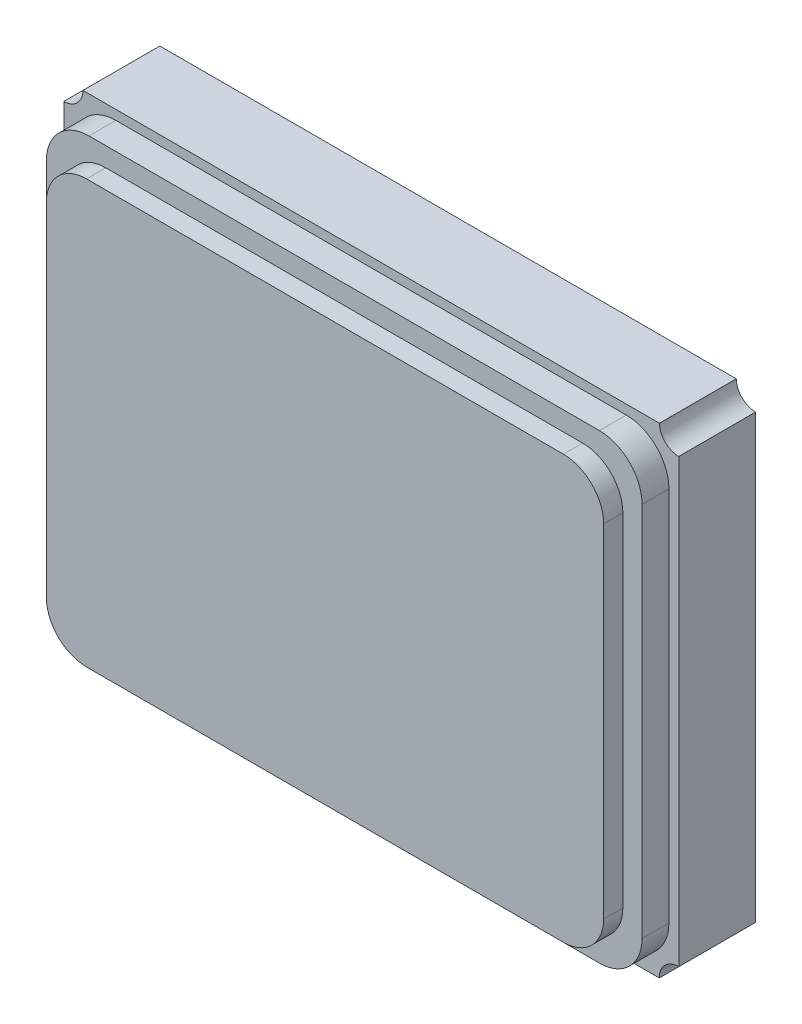
ISO-10303-21;
HEADER;
FILE_DESCRIPTION(('STEP AP214'),'2;1');
FILE_NAME('part.step','',(''),(''),'','','');
FILE_SCHEMA(('AUTOMOTIVE_DESIGN { 1 0 10303 214 1 1 1 1 }'));
ENDSEC;
DATA;
#1=APPLICATION_CONTEXT('core data for automotive mechanical design processes');
#2=APPLICATION_PROTOCOL_DEFINITION('international standard','automotive_design',2000,#1);
#3=PRODUCT_CONTEXT('',#1,'mechanical');
#4=PRODUCT('Part','Part','',(#3));
#5=PRODUCT_RELATED_PRODUCT_CATEGORY('part','',(#4));
#6=PRODUCT_DEFINITION_FORMATION('','',#4);
#7=PRODUCT_DEFINITION_CONTEXT('part definition',#1,'design');
#8=PRODUCT_DEFINITION('design','',#6,#7);
#9=PRODUCT_DEFINITION_SHAPE('','',#8);
#10=(LENGTH_UNIT() NAMED_UNIT(*) SI_UNIT(.MILLI.,.METRE.));
#11=(NAMED_UNIT(*) PLANE_ANGLE_UNIT() SI_UNIT($,.RADIAN.));
#12=(NAMED_UNIT(*) SI_UNIT($,.STERADIAN.) SOLID_ANGLE_UNIT());
#13=UNCERTAINTY_MEASURE_WITH_UNIT(LENGTH_MEASURE(1.E-05),#10,'distance_accuracy_value','');
#14=(GEOMETRIC_REPRESENTATION_CONTEXT(3) GLOBAL_UNCERTAINTY_ASSIGNED_CONTEXT((#13)) GLOBAL_UNIT_ASSIGNED_CONTEXT((#10,
#11,#12)) REPRESENTATION_CONTEXT('',''));
#15=CARTESIAN_POINT('',(0.,0.,0.));
#16=DIRECTION('',(0.,0.,1.));
#17=DIRECTION('',(1.,0.,0.));
#18=AXIS2_PLACEMENT_3D('',#15,#16,#17);
#19=CARTESIAN_POINT('',(0.0008802163144183,-0.0008850774637298,0.));
#20=DIRECTION('',(0.,0.,1.));
#21=DIRECTION('',(1.,0.,0.));
#22=AXIS2_PLACEMENT_3D('',#19,#20,#21);
#23=PLANE('',#22);
#24=DIRECTION('',(1.,0.,0.));
#25=VECTOR('',#24,1.);
#26=CARTESIAN_POINT('',(-1.499580396422,1.249506131818,0.));
#27=LINE('',#26,#25);
#28=CARTESIAN_POINT('',(-1.499580396422,1.249506131818,0.));
#29=VERTEX_POINT('',#28);
#30=CARTESIAN_POINT('',(1.500419603578,1.249506131818,0.));
#31=VERTEX_POINT('',#30);
#32=EDGE_CURVE('E376',#29,#31,#27,.T.);
#33=ORIENTED_EDGE('',*,*,#32,.T.);
#34=CARTESIAN_POINT('',(1.600419603578,1.250214196517,0.));
#35=DIRECTION('',(0.,0.,1.));
#36=DIRECTION('',(1.,0.,0.));
#37=AXIS2_PLACEMENT_3D('',#34,#35,#36);
#38=CIRCLE('',#37,0.100002506747);
#39=CARTESIAN_POINT('',(1.601127668277,1.150214196517,0.));
#40=VERTEX_POINT('',#39);
#41=EDGE_CURVE('E147',#31,#40,#38,.T.);
#42=ORIENTED_EDGE('',*,*,#41,.T.);
#43=DIRECTION('',(0.,-1.,0.));
#44=VECTOR('',#43,1.);
#45=CARTESIAN_POINT('',(1.601127668277,1.150214196517,0.));
#46=LINE('',#45,#44);
#47=CARTESIAN_POINT('',(1.601127668277,-1.149785803483,0.));
#48=VERTEX_POINT('',#47);
#49=EDGE_CURVE('E357',#40,#48,#46,.T.);
#50=ORIENTED_EDGE('',*,*,#49,.T.);
#51=CARTESIAN_POINT('',(1.599580396422,-1.249785803483,0.));
#52=DIRECTION('',(0.,0.,1.));
#53=DIRECTION('',(1.,0.,0.));
#54=AXIS2_PLACEMENT_3D('',#51,#52,#53);
#55=CIRCLE('',#54,0.100011969535);
#56=CARTESIAN_POINT('',(1.499580396422,-1.251333075338,0.));
#57=VERTEX_POINT('',#56);
#58=EDGE_CURVE('E28',#48,#57,#55,.T.);
#59=ORIENTED_EDGE('',*,*,#58,.T.);
#60=DIRECTION('',(-1.,0.,0.));
#61=VECTOR('',#60,1.);
#62=CARTESIAN_POINT('',(1.499580396422,-1.251333075338,0.));
#63=LINE('',#62,#61);
#64=CARTESIAN_POINT('',(-1.500419603578,-1.251333075338,0.));
#65=VERTEX_POINT('',#64);
#66=EDGE_CURVE('E11',#57,#65,#63,.T.);
#67=ORIENTED_EDGE('',*,*,#66,.T.);
#68=CARTESIAN_POINT('',(-1.600419603578,-1.250214196517,0.));
#69=DIRECTION('',(0.,0.,1.));
#70=DIRECTION('',(1.,0.,0.));
#71=AXIS2_PLACEMENT_3D('',#68,#69,#70);
#72=CIRCLE('',#71,0.100006259253);
#73=CARTESIAN_POINT('',(-1.599300724757,-1.150214196517,0.));
#74=VERTEX_POINT('',#73);
#75=EDGE_CURVE('E324',#65,#74,#72,.T.);
#76=ORIENTED_EDGE('',*,*,#75,.T.);
#77=DIRECTION('',(0.,1.,0.));
#78=VECTOR('',#77,1.);
#79=CARTESIAN_POINT('',(-1.599300724757,-1.150214196517,0.));
#80=LINE('',#79,#78);
#81=CARTESIAN_POINT('',(-1.599300724757,1.149785803483,0.));
#82=VERTEX_POINT('',#81);
#83=EDGE_CURVE('E349',#74,#82,#80,.T.);
#84=ORIENTED_EDGE('',*,*,#83,.T.);
#85=CARTESIAN_POINT('',(-1.599580396422,1.249785803483,0.));
#86=DIRECTION('',(0.,0.,1.));
#87=DIRECTION('',(1.,0.,0.));
#88=AXIS2_PLACEMENT_3D('',#85,#86,#87);
#89=CIRCLE('',#88,0.10000039108);
#90=EDGE_CURVE('E158',#82,#29,#89,.T.);
#91=ORIENTED_EDGE('',*,*,#90,.T.);
#92=EDGE_LOOP('',(#33,#42,#50,#59,#67,#76,#84,#91));
#93=FACE_BOUND('',#92,.T.);
#94=ADVANCED_FACE('F17',(#93),#23,.F.);
#95=CARTESIAN_POINT('',(1.499580396422,-1.251333075338,0.));
#96=DIRECTION('',(0.,-1.,0.));
#97=DIRECTION('',(0.,0.,-1.));
#98=AXIS2_PLACEMENT_3D('',#95,#96,#97);
#99=PLANE('',#98);
#100=DIRECTION('',(0.,0.,1.));
#101=VECTOR('',#100,1.);
#102=CARTESIAN_POINT('',(1.499580396422,-1.251333075338,0.));
#103=LINE('',#102,#101);
#104=CARTESIAN_POINT('',(1.499580396422,-1.251333075338,0.4));
#105=VERTEX_POINT('',#104);
#106=EDGE_CURVE('E174',#57,#105,#103,.T.);
#107=ORIENTED_EDGE('',*,*,#106,.T.);
#108=DIRECTION('',(-1.,0.,0.));
#109=VECTOR('',#108,1.);
#110=CARTESIAN_POINT('',(1.499580396422,-1.251333075338,0.4));
#111=LINE('',#110,#109);
#112=CARTESIAN_POINT('',(-1.500419603578,-1.251333075338,0.4));
#113=VERTEX_POINT('',#112);
#114=EDGE_CURVE('E304',#105,#113,#111,.T.);
#115=ORIENTED_EDGE('',*,*,#114,.T.);
#116=DIRECTION('',(0.,0.,1.));
#117=VECTOR('',#116,1.);
#118=CARTESIAN_POINT('',(-1.500419603578,-1.251333075338,0.));
#119=LINE('',#118,#117);
#120=EDGE_CURVE('E21',#65,#113,#119,.T.);
#121=ORIENTED_EDGE('',*,*,#120,.F.);
#122=ORIENTED_EDGE('',*,*,#66,.F.);
#123=EDGE_LOOP('',(#107,#115,#121,#122));
#124=FACE_BOUND('',#123,.T.);
#125=ADVANCED_FACE('F600',(#124),#99,.T.);
#126=CARTESIAN_POINT('',(1.599580396422,-1.249785803483,0.));
#127=DIRECTION('',(0.,0.,-1.));
#128=DIRECTION('',(1.,0.,0.));
#129=AXIS2_PLACEMENT_3D('',#126,#127,#128);
#130=CYLINDRICAL_SURFACE('',#129,0.100011969535);
#131=DIRECTION('',(0.,0.,1.));
#132=VECTOR('',#131,1.);
#133=CARTESIAN_POINT('',(1.601127668277,-1.149785803483,0.));
#134=LINE('',#133,#132);
#135=CARTESIAN_POINT('',(1.601127668277,-1.149785803483,0.4));
#136=VERTEX_POINT('',#135);
#137=EDGE_CURVE('E354',#48,#136,#134,.T.);
#138=ORIENTED_EDGE('',*,*,#137,.T.);
#139=CARTESIAN_POINT('',(1.599580396422,-1.249785803483,0.4));
#140=DIRECTION('',(0.,0.,1.));
#141=DIRECTION('',(1.,0.,0.));
#142=AXIS2_PLACEMENT_3D('',#139,#140,#141);
#143=CIRCLE('',#142,0.100011969535);
#144=EDGE_CURVE('E307',#136,#105,#143,.T.);
#145=ORIENTED_EDGE('',*,*,#144,.T.);
#146=ORIENTED_EDGE('',*,*,#106,.F.);
#147=ORIENTED_EDGE('',*,*,#58,.F.);
#148=EDGE_LOOP('',(#138,#145,#146,#147));
#149=FACE_BOUND('',#148,.T.);
#150=ADVANCED_FACE('F605',(#149),#130,.F.);
#151=CARTESIAN_POINT('',(-1.600419603578,-1.250214196517,0.));
#152=DIRECTION('',(0.,0.,-1.));
#153=DIRECTION('',(1.,0.,0.));
#154=AXIS2_PLACEMENT_3D('',#151,#152,#153);
#155=CYLINDRICAL_SURFACE('',#154,0.100006259253);
#156=ORIENTED_EDGE('',*,*,#120,.T.);
#157=CARTESIAN_POINT('',(-1.600419603578,-1.250214196517,0.4));
#158=DIRECTION('',(0.,0.,1.));
#159=DIRECTION('',(1.,0.,0.));
#160=AXIS2_PLACEMENT_3D('',#157,#158,#159);
#161=CIRCLE('',#160,0.100006259253);
#162=CARTESIAN_POINT('',(-1.599300724757,-1.150214196517,0.4));
#163=VERTEX_POINT('',#162);
#164=EDGE_CURVE('E308',#113,#163,#161,.T.);
#165=ORIENTED_EDGE('',*,*,#164,.T.);
#166=DIRECTION('',(0.,0.,1.));
#167=VECTOR('',#166,1.);
#168=CARTESIAN_POINT('',(-1.599300724757,-1.150214196517,0.));
#169=LINE('',#168,#167);
#170=EDGE_CURVE('E346',#74,#163,#169,.T.);
#171=ORIENTED_EDGE('',*,*,#170,.F.);
#172=ORIENTED_EDGE('',*,*,#75,.F.);
#173=EDGE_LOOP('',(#156,#165,#171,#172));
#174=FACE_BOUND('',#173,.T.);
#175=ADVANCED_FACE('F630',(#174),#155,.F.);
#176=CARTESIAN_POINT('',(1.601127668277,1.150214196517,0.));
#177=DIRECTION('',(1.,0.,0.));
#178=DIRECTION('',(0.,1.,0.));
#179=AXIS2_PLACEMENT_3D('',#176,#177,#178);
#180=PLANE('',#179);
#181=DIRECTION('',(0.,0.,1.));
#182=VECTOR('',#181,1.);
#183=CARTESIAN_POINT('',(1.601127668277,1.150214196517,0.));
#184=LINE('',#183,#182);
#185=CARTESIAN_POINT('',(1.601127668277,1.150214196517,0.4));
#186=VERTEX_POINT('',#185);
#187=EDGE_CURVE('E319',#40,#186,#184,.T.);
#188=ORIENTED_EDGE('',*,*,#187,.T.);
#189=DIRECTION('',(0.,-1.,0.));
#190=VECTOR('',#189,1.);
#191=CARTESIAN_POINT('',(1.601127668277,1.150214196517,0.4));
#192=LINE('',#191,#190);
#193=EDGE_CURVE('E314',#186,#136,#192,.T.);
#194=ORIENTED_EDGE('',*,*,#193,.T.);
#195=ORIENTED_EDGE('',*,*,#137,.F.);
#196=ORIENTED_EDGE('',*,*,#49,.F.);
#197=EDGE_LOOP('',(#188,#194,#195,#196));
#198=FACE_BOUND('',#197,.T.);
#199=ADVANCED_FACE('F609',(#198),#180,.T.);
#200=CARTESIAN_POINT('',(-1.599300724757,-1.150214196517,0.));
#201=DIRECTION('',(-1.,0.,0.));
#202=DIRECTION('',(0.,0.,1.));
#203=AXIS2_PLACEMENT_3D('',#200,#201,#202);
#204=PLANE('',#203);
#205=ORIENTED_EDGE('',*,*,#170,.T.);
#206=DIRECTION('',(0.,1.,0.));
#207=VECTOR('',#206,1.);
#208=CARTESIAN_POINT('',(-1.599300724757,-1.150214196517,0.4));
#209=LINE('',#208,#207);
#210=CARTESIAN_POINT('',(-1.599300724757,1.149785803483,0.4));
#211=VERTEX_POINT('',#210);
#212=EDGE_CURVE('E362',#163,#211,#209,.T.);
#213=ORIENTED_EDGE('',*,*,#212,.T.);
#214=DIRECTION('',(0.,0.,1.));
#215=VECTOR('',#214,1.);
#216=CARTESIAN_POINT('',(-1.599300724757,1.149785803483,0.));
#217=LINE('',#216,#215);
#218=EDGE_CURVE('E379',#82,#211,#217,.T.);
#219=ORIENTED_EDGE('',*,*,#218,.F.);
#220=ORIENTED_EDGE('',*,*,#83,.F.);
#221=EDGE_LOOP('',(#205,#213,#219,#220));
#222=FACE_BOUND('',#221,.T.);
#223=ADVANCED_FACE('F645',(#222),#204,.T.);
#224=CARTESIAN_POINT('',(1.600419603578,1.250214196517,0.));
#225=DIRECTION('',(0.,0.,-1.));
#226=DIRECTION('',(1.,0.,0.));
#227=AXIS2_PLACEMENT_3D('',#224,#225,#226);
#228=CYLINDRICAL_SURFACE('',#227,0.100002506747);
#229=DIRECTION('',(0.,0.,1.));
#230=VECTOR('',#229,1.);
#231=CARTESIAN_POINT('',(1.500419603578,1.249506131818,0.));
#232=LINE('',#231,#230);
#233=CARTESIAN_POINT('',(1.500419603578,1.249506131818,0.4));
#234=VERTEX_POINT('',#233);
#235=EDGE_CURVE('E380',#31,#234,#232,.T.);
#236=ORIENTED_EDGE('',*,*,#235,.T.);
#237=CARTESIAN_POINT('',(1.600419603578,1.250214196517,0.4));
#238=DIRECTION('',(0.,0.,1.));
#239=DIRECTION('',(1.,0.,0.));
#240=AXIS2_PLACEMENT_3D('',#237,#238,#239);
#241=CIRCLE('',#240,0.100002506747);
#242=EDGE_CURVE('E318',#234,#186,#241,.T.);
#243=ORIENTED_EDGE('',*,*,#242,.T.);
#244=ORIENTED_EDGE('',*,*,#187,.F.);
#245=ORIENTED_EDGE('',*,*,#41,.F.);
#246=EDGE_LOOP('',(#236,#243,#244,#245));
#247=FACE_BOUND('',#246,.T.);
#248=ADVANCED_FACE('F466',(#247),#228,.F.);
#249=CARTESIAN_POINT('',(-1.599580396422,1.249785803483,0.));
#250=DIRECTION('',(0.,0.,-1.));
#251=DIRECTION('',(1.,0.,0.));
#252=AXIS2_PLACEMENT_3D('',#249,#250,#251);
#253=CYLINDRICAL_SURFACE('',#252,0.10000039108);
#254=ORIENTED_EDGE('',*,*,#218,.T.);
#255=CARTESIAN_POINT('',(-1.599580396422,1.249785803483,0.4));
#256=DIRECTION('',(0.,0.,1.));
#257=DIRECTION('',(1.,0.,0.));
#258=AXIS2_PLACEMENT_3D('',#255,#256,#257);
#259=CIRCLE('',#258,0.10000039108);
#260=CARTESIAN_POINT('',(-1.499580396422,1.249506131818,0.4));
#261=VERTEX_POINT('',#260);
#262=EDGE_CURVE('E358',#211,#261,#259,.T.);
#263=ORIENTED_EDGE('',*,*,#262,.T.);
#264=DIRECTION('',(0.,0.,1.));
#265=VECTOR('',#264,1.);
#266=CARTESIAN_POINT('',(-1.499580396422,1.249506131818,0.));
#267=LINE('',#266,#265);
#268=EDGE_CURVE('E395',#29,#261,#267,.T.);
#269=ORIENTED_EDGE('',*,*,#268,.F.);
#270=ORIENTED_EDGE('',*,*,#90,.F.);
#271=EDGE_LOOP('',(#254,#263,#269,#270));
#272=FACE_BOUND('',#271,.T.);
#273=ADVANCED_FACE('F477',(#272),#253,.F.);
#274=CARTESIAN_POINT('',(-1.499580396422,1.249506131818,0.));
#275=DIRECTION('',(0.,1.,0.));
#276=DIRECTION('',(1.,0.,0.));
#277=AXIS2_PLACEMENT_3D('',#274,#275,#276);
#278=PLANE('',#277);
#279=ORIENTED_EDGE('',*,*,#268,.T.);
#280=DIRECTION('',(1.,0.,0.));
#281=VECTOR('',#280,1.);
#282=CARTESIAN_POINT('',(-1.499580396422,1.249506131818,0.4));
#283=LINE('',#282,#281);
#284=EDGE_CURVE('E363',#261,#234,#283,.T.);
#285=ORIENTED_EDGE('',*,*,#284,.T.);
#286=ORIENTED_EDGE('',*,*,#235,.F.);
#287=ORIENTED_EDGE('',*,*,#32,.F.);
#288=EDGE_LOOP('',(#279,#285,#286,#287));
#289=FACE_BOUND('',#288,.T.);
#290=ADVANCED_FACE('F474',(#289),#278,.T.);
#291=CARTESIAN_POINT('',(0.0008802163144183,-0.0008850774637298,0.4));
#292=DIRECTION('',(0.,0.,1.));
#293=DIRECTION('',(1.,0.,0.));
#294=AXIS2_PLACEMENT_3D('',#291,#292,#293);
#295=PLANE('',#294);
#296=CARTESIAN_POINT('',(1.328205850256,-0.978205850256,0.4));
#297=DIRECTION('',(0.,0.,-1.));
#298=DIRECTION('',(1.,0.,0.));
#299=AXIS2_PLACEMENT_3D('',#296,#297,#298);
#300=CIRCLE('',#299,0.221794149744);
#301=CARTESIAN_POINT('',(1.55,-0.978205850256,0.4));
#302=VERTEX_POINT('',#301);
#303=CARTESIAN_POINT('',(1.328205850256,-1.2,0.4));
#304=VERTEX_POINT('',#303);
#305=EDGE_CURVE('E266',#302,#304,#300,.T.);
#306=ORIENTED_EDGE('',*,*,#305,.T.);
#307=DIRECTION('',(-1.,0.,0.));
#308=VECTOR('',#307,1.);
#309=CARTESIAN_POINT('',(-0.663662816971,-1.2,0.4));
#310=LINE('',#309,#308);
#311=CARTESIAN_POINT('',(-1.328205850256,-1.2,0.4));
#312=VERTEX_POINT('',#311);
#313=EDGE_CURVE('E429',#304,#312,#310,.T.);
#314=ORIENTED_EDGE('',*,*,#313,.T.);
#315=CARTESIAN_POINT('',(-1.328205850256,-0.978205850256,0.4));
#316=DIRECTION('',(0.,0.,-1.));
#317=DIRECTION('',(1.,0.,0.));
#318=AXIS2_PLACEMENT_3D('',#315,#316,#317);
#319=CIRCLE('',#318,0.221794149744);
#320=CARTESIAN_POINT('',(-1.55,-0.978205850256,0.4));
#321=VERTEX_POINT('',#320);
#322=EDGE_CURVE('E303',#312,#321,#319,.T.);
#323=ORIENTED_EDGE('',*,*,#322,.T.);
#324=DIRECTION('',(0.,1.,0.));
#325=VECTOR('',#324,1.);
#326=CARTESIAN_POINT('',(-1.55,0.488660386396,0.4));
#327=LINE('',#326,#325);
#328=CARTESIAN_POINT('',(-1.55,0.978205850256,0.4));
#329=VERTEX_POINT('',#328);
#330=EDGE_CURVE('E265',#321,#329,#327,.T.);
#331=ORIENTED_EDGE('',*,*,#330,.T.);
#332=CARTESIAN_POINT('',(-1.328205850256,0.978205850256,0.4));
#333=DIRECTION('',(0.,0.,-1.));
#334=DIRECTION('',(1.,0.,0.));
#335=AXIS2_PLACEMENT_3D('',#332,#333,#334);
#336=CIRCLE('',#335,0.221794149744);
#337=CARTESIAN_POINT('',(-1.328205850256,1.2,0.4));
#338=VERTEX_POINT('',#337);
#339=EDGE_CURVE('E261',#329,#338,#336,.T.);
#340=ORIENTED_EDGE('',*,*,#339,.T.);
#341=DIRECTION('',(1.,0.,0.));
#342=VECTOR('',#341,1.);
#343=CARTESIAN_POINT('',(0.664543033285,1.2,0.4));
#344=LINE('',#343,#342);
#345=CARTESIAN_POINT('',(1.328205850256,1.2,0.4));
#346=VERTEX_POINT('',#345);
#347=EDGE_CURVE('E401',#338,#346,#344,.T.);
#348=ORIENTED_EDGE('',*,*,#347,.T.);
#349=CARTESIAN_POINT('',(1.328205850256,0.978205850256,0.4));
#350=DIRECTION('',(0.,0.,-1.));
#351=DIRECTION('',(1.,0.,0.));
#352=AXIS2_PLACEMENT_3D('',#349,#350,#351);
#353=CIRCLE('',#352,0.221794149744);
#354=CARTESIAN_POINT('',(1.55,0.978205850256,0.4));
#355=VERTEX_POINT('',#354);
#356=EDGE_CURVE('E397',#346,#355,#353,.T.);
#357=ORIENTED_EDGE('',*,*,#356,.T.);
#358=DIRECTION('',(0.,-1.,0.));
#359=VECTOR('',#358,1.);
#360=CARTESIAN_POINT('',(1.55,-0.48954546386,0.4));
#361=LINE('',#360,#359);
#362=EDGE_CURVE('E342',#355,#302,#361,.T.);
#363=ORIENTED_EDGE('',*,*,#362,.T.);
#364=EDGE_LOOP('',(#306,#314,#323,#331,#340,#348,#357,#363));
#365=FACE_BOUND('',#364,.T.);
#366=ORIENTED_EDGE('',*,*,#284,.F.);
#367=ORIENTED_EDGE('',*,*,#262,.F.);
#368=ORIENTED_EDGE('',*,*,#212,.F.);
#369=ORIENTED_EDGE('',*,*,#164,.F.);
#370=ORIENTED_EDGE('',*,*,#114,.F.);
#371=ORIENTED_EDGE('',*,*,#144,.F.);
#372=ORIENTED_EDGE('',*,*,#193,.F.);
#373=ORIENTED_EDGE('',*,*,#242,.F.);
#374=EDGE_LOOP('',(#366,#367,#368,#369,#370,#371,#372,#373));
#375=FACE_BOUND('',#374,.T.);
#376=ADVANCED_FACE('F471',(#365,#375),#295,.T.);
#377=CARTESIAN_POINT('',(1.328205850256,1.2,0.39));
#378=DIRECTION('',(0.,-1.,0.));
#379=DIRECTION('',(0.,0.,-1.));
#380=AXIS2_PLACEMENT_3D('',#377,#378,#379);
#381=PLANE('',#380);
#382=DIRECTION('',(0.,0.,1.));
#383=VECTOR('',#382,1.);
#384=CARTESIAN_POINT('',(-1.328205850256,1.2,0.39));
#385=LINE('',#384,#383);
#386=CARTESIAN_POINT('',(-1.328205850256,1.2,0.54));
#387=VERTEX_POINT('',#386);
#388=EDGE_CURVE('E345',#338,#387,#385,.T.);
#389=ORIENTED_EDGE('',*,*,#388,.T.);
#390=DIRECTION('',(-1.,0.,0.));
#391=VECTOR('',#390,1.);
#392=CARTESIAN_POINT('',(1.328205850256,1.2,0.54));
#393=LINE('',#392,#391);
#394=CARTESIAN_POINT('',(1.328205850256,1.2,0.54));
#395=VERTEX_POINT('',#394);
#396=EDGE_CURVE('E283',#395,#387,#393,.T.);
#397=ORIENTED_EDGE('',*,*,#396,.F.);
#398=DIRECTION('',(0.,0.,1.));
#399=VECTOR('',#398,1.);
#400=CARTESIAN_POINT('',(1.328205850256,1.2,0.39));
#401=LINE('',#400,#399);
#402=EDGE_CURVE('E402',#346,#395,#401,.T.);
#403=ORIENTED_EDGE('',*,*,#402,.F.);
#404=ORIENTED_EDGE('',*,*,#347,.F.);
#405=EDGE_LOOP('',(#389,#397,#403,#404));
#406=FACE_BOUND('',#405,.T.);
#407=ADVANCED_FACE('F531',(#406),#381,.F.);
#408=CARTESIAN_POINT('',(1.328205850256,0.978205850256,0.39));
#409=DIRECTION('',(0.,0.,-1.));
#410=DIRECTION('',(1.,0.,0.));
#411=AXIS2_PLACEMENT_3D('',#408,#409,#410);
#412=CYLINDRICAL_SURFACE('',#411,0.221794149744);
#413=ORIENTED_EDGE('',*,*,#402,.T.);
#414=CARTESIAN_POINT('',(1.328205850256,0.978205850256,0.54));
#415=DIRECTION('',(0.,0.,1.));
#416=DIRECTION('',(1.,0.,0.));
#417=AXIS2_PLACEMENT_3D('',#414,#415,#416);
#418=CIRCLE('',#417,0.221794149744);
#419=CARTESIAN_POINT('',(1.55,0.978205850256,0.54));
#420=VERTEX_POINT('',#419);
#421=EDGE_CURVE('E289',#420,#395,#418,.T.);
#422=ORIENTED_EDGE('',*,*,#421,.F.);
#423=DIRECTION('',(0.,0.,1.));
#424=VECTOR('',#423,1.);
#425=CARTESIAN_POINT('',(1.55,0.978205850256,0.39));
#426=LINE('',#425,#424);
#427=EDGE_CURVE('E327',#355,#420,#426,.T.);
#428=ORIENTED_EDGE('',*,*,#427,.F.);
#429=ORIENTED_EDGE('',*,*,#356,.F.);
#430=EDGE_LOOP('',(#413,#422,#428,#429));
#431=FACE_BOUND('',#430,.T.);
#432=ADVANCED_FACE('F528',(#431),#412,.T.);
#433=CARTESIAN_POINT('',(-1.328205850256,0.978205850256,0.39));
#434=DIRECTION('',(0.,0.,-1.));
#435=DIRECTION('',(1.,0.,0.));
#436=AXIS2_PLACEMENT_3D('',#433,#434,#435);
#437=CYLINDRICAL_SURFACE('',#436,0.221794149744);
#438=DIRECTION('',(0.,0.,1.));
#439=VECTOR('',#438,1.);
#440=CARTESIAN_POINT('',(-1.55,0.978205850256,0.39));
#441=LINE('',#440,#439);
#442=CARTESIAN_POINT('',(-1.55,0.978205850256,0.54));
#443=VERTEX_POINT('',#442);
#444=EDGE_CURVE('E253',#329,#443,#441,.T.);
#445=ORIENTED_EDGE('',*,*,#444,.T.);
#446=CARTESIAN_POINT('',(-1.328205850256,0.978205850256,0.54));
#447=DIRECTION('',(0.,0.,1.));
#448=DIRECTION('',(1.,0.,0.));
#449=AXIS2_PLACEMENT_3D('',#446,#447,#448);
#450=CIRCLE('',#449,0.221794149744);
#451=EDGE_CURVE('E258',#387,#443,#450,.T.);
#452=ORIENTED_EDGE('',*,*,#451,.F.);
#453=ORIENTED_EDGE('',*,*,#388,.F.);
#454=ORIENTED_EDGE('',*,*,#339,.F.);
#455=EDGE_LOOP('',(#445,#452,#453,#454));
#456=FACE_BOUND('',#455,.T.);
#457=ADVANCED_FACE('F255',(#456),#437,.T.);
#458=CARTESIAN_POINT('',(1.55,-0.978205850256,0.39));
#459=DIRECTION('',(-1.,0.,0.));
#460=DIRECTION('',(0.,0.,1.));
#461=AXIS2_PLACEMENT_3D('',#458,#459,#460);
#462=PLANE('',#461);
#463=ORIENTED_EDGE('',*,*,#427,.T.);
#464=DIRECTION('',(0.,1.,0.));
#465=VECTOR('',#464,1.);
#466=CARTESIAN_POINT('',(1.55,-0.978205850256,0.54));
#467=LINE('',#466,#465);
#468=CARTESIAN_POINT('',(1.55,-0.978205850256,0.54));
#469=VERTEX_POINT('',#468);
#470=EDGE_CURVE('E292',#469,#420,#467,.T.);
#471=ORIENTED_EDGE('',*,*,#470,.F.);
#472=DIRECTION('',(0.,0.,1.));
#473=VECTOR('',#472,1.);
#474=CARTESIAN_POINT('',(1.55,-0.978205850256,0.39));
#475=LINE('',#474,#473);
#476=EDGE_CURVE('E207',#302,#469,#475,.T.);
#477=ORIENTED_EDGE('',*,*,#476,.F.);
#478=ORIENTED_EDGE('',*,*,#362,.F.);
#479=EDGE_LOOP('',(#463,#471,#477,#478));
#480=FACE_BOUND('',#479,.T.);
#481=ADVANCED_FACE('F523',(#480),#462,.F.);
#482=CARTESIAN_POINT('',(-1.55,0.978205850256,0.39));
#483=DIRECTION('',(1.,0.,0.));
#484=DIRECTION('',(0.,1.,0.));
#485=AXIS2_PLACEMENT_3D('',#482,#483,#484);
#486=PLANE('',#485);
#487=DIRECTION('',(0.,0.,1.));
#488=VECTOR('',#487,1.);
#489=CARTESIAN_POINT('',(-1.55,-0.978205850256,0.39));
#490=LINE('',#489,#488);
#491=CARTESIAN_POINT('',(-1.55,-0.978205850256,0.54));
#492=VERTEX_POINT('',#491);
#493=EDGE_CURVE('E272',#321,#492,#490,.T.);
#494=ORIENTED_EDGE('',*,*,#493,.T.);
#495=DIRECTION('',(0.,-1.,0.));
#496=VECTOR('',#495,1.);
#497=CARTESIAN_POINT('',(-1.55,0.978205850256,0.54));
#498=LINE('',#497,#496);
#499=EDGE_CURVE('E269',#443,#492,#498,.T.);
#500=ORIENTED_EDGE('',*,*,#499,.F.);
#501=ORIENTED_EDGE('',*,*,#444,.F.);
#502=ORIENTED_EDGE('',*,*,#330,.F.);
#503=EDGE_LOOP('',(#494,#500,#501,#502));
#504=FACE_BOUND('',#503,.T.);
#505=ADVANCED_FACE('F270',(#504),#486,.F.);
#506=CARTESIAN_POINT('',(1.328205850256,-0.978205850256,0.39));
#507=DIRECTION('',(0.,0.,-1.));
#508=DIRECTION('',(1.,0.,0.));
#509=AXIS2_PLACEMENT_3D('',#506,#507,#508);
#510=CYLINDRICAL_SURFACE('',#509,0.221794149744);
#511=ORIENTED_EDGE('',*,*,#476,.T.);
#512=CARTESIAN_POINT('',(1.328205850256,-0.978205850256,0.54));
#513=DIRECTION('',(0.,0.,1.));
#514=DIRECTION('',(1.,0.,0.));
#515=AXIS2_PLACEMENT_3D('',#512,#513,#514);
#516=CIRCLE('',#515,0.221794149744);
#517=CARTESIAN_POINT('',(1.328205850256,-1.2,0.54));
#518=VERTEX_POINT('',#517);
#519=EDGE_CURVE('E495',#518,#469,#516,.T.);
#520=ORIENTED_EDGE('',*,*,#519,.F.);
#521=DIRECTION('',(0.,0.,1.));
#522=VECTOR('',#521,1.);
#523=CARTESIAN_POINT('',(1.328205850256,-1.2,0.39));
#524=LINE('',#523,#522);
#525=EDGE_CURVE('E219',#304,#518,#524,.T.);
#526=ORIENTED_EDGE('',*,*,#525,.F.);
#527=ORIENTED_EDGE('',*,*,#305,.F.);
#528=EDGE_LOOP('',(#511,#520,#526,#527));
#529=FACE_BOUND('',#528,.T.);
#530=ADVANCED_FACE('F615',(#529),#510,.T.);
#531=CARTESIAN_POINT('',(-1.328205850256,-0.978205850256,0.39));
#532=DIRECTION('',(0.,0.,-1.));
#533=DIRECTION('',(1.,0.,0.));
#534=AXIS2_PLACEMENT_3D('',#531,#532,#533);
#535=CYLINDRICAL_SURFACE('',#534,0.221794149744);
#536=DIRECTION('',(0.,0.,1.));
#537=VECTOR('',#536,1.);
#538=CARTESIAN_POINT('',(-1.328205850256,-1.2,0.39));
#539=LINE('',#538,#537);
#540=CARTESIAN_POINT('',(-1.328205850256,-1.2,0.54));
#541=VERTEX_POINT('',#540);
#542=EDGE_CURVE('E433',#312,#541,#539,.T.);
#543=ORIENTED_EDGE('',*,*,#542,.T.);
#544=CARTESIAN_POINT('',(-1.328205850256,-0.978205850256,0.54));
#545=DIRECTION('',(0.,0.,1.));
#546=DIRECTION('',(1.,0.,0.));
#547=AXIS2_PLACEMENT_3D('',#544,#545,#546);
#548=CIRCLE('',#547,0.221794149744);
#549=EDGE_CURVE('E277',#492,#541,#548,.T.);
#550=ORIENTED_EDGE('',*,*,#549,.F.);
#551=ORIENTED_EDGE('',*,*,#493,.F.);
#552=ORIENTED_EDGE('',*,*,#322,.F.);
#553=EDGE_LOOP('',(#543,#550,#551,#552));
#554=FACE_BOUND('',#553,.T.);
#555=ADVANCED_FACE('F618',(#554),#535,.T.);
#556=CARTESIAN_POINT('',(-1.328205850256,-1.2,0.39));
#557=DIRECTION('',(0.,1.,0.));
#558=DIRECTION('',(1.,0.,0.));
#559=AXIS2_PLACEMENT_3D('',#556,#557,#558);
#560=PLANE('',#559);
#561=ORIENTED_EDGE('',*,*,#525,.T.);
#562=DIRECTION('',(1.,0.,0.));
#563=VECTOR('',#562,1.);
#564=CARTESIAN_POINT('',(-1.328205850256,-1.2,0.54));
#565=LINE('',#564,#563);
#566=EDGE_CURVE('E369',#541,#518,#565,.T.);
#567=ORIENTED_EDGE('',*,*,#566,.F.);
#568=ORIENTED_EDGE('',*,*,#542,.F.);
#569=ORIENTED_EDGE('',*,*,#313,.F.);
#570=EDGE_LOOP('',(#561,#567,#568,#569));
#571=FACE_BOUND('',#570,.T.);
#572=ADVANCED_FACE('F595',(#571),#560,.F.);
#573=CARTESIAN_POINT('',(0.,0.,0.54));
#574=DIRECTION('',(0.,0.,1.));
#575=DIRECTION('',(1.,0.,0.));
#576=AXIS2_PLACEMENT_3D('',#573,#574,#575);
#577=PLANE('',#576);
#578=DIRECTION('',(1.,0.,0.));
#579=VECTOR('',#578,1.);
#580=CARTESIAN_POINT('',(-1.240692780974,-1.1,0.54));
#581=LINE('',#580,#579);
#582=CARTESIAN_POINT('',(-1.240692780974,-1.1,0.54));
#583=VERTEX_POINT('',#582);
#584=CARTESIAN_POINT('',(1.240692780974,-1.1,0.54));
#585=VERTEX_POINT('',#584);
#586=EDGE_CURVE('E387',#583,#585,#581,.T.);
#587=ORIENTED_EDGE('',*,*,#586,.F.);
#588=CARTESIAN_POINT('',(-1.240692780974,-0.890692780974,0.54));
#589=DIRECTION('',(0.,0.,1.));
#590=DIRECTION('',(1.,0.,0.));
#591=AXIS2_PLACEMENT_3D('',#588,#589,#590);
#592=CIRCLE('',#591,0.209307219026);
#593=CARTESIAN_POINT('',(-1.45,-0.890692780974,0.54));
#594=VERTEX_POINT('',#593);
#595=EDGE_CURVE('E366',#594,#583,#592,.T.);
#596=ORIENTED_EDGE('',*,*,#595,.F.);
#597=DIRECTION('',(0.,-1.,0.));
#598=VECTOR('',#597,1.);
#599=CARTESIAN_POINT('',(-1.45,0.890692780974,0.54));
#600=LINE('',#599,#598);
#601=CARTESIAN_POINT('',(-1.45,0.890692780974,0.54));
#602=VERTEX_POINT('',#601);
#603=EDGE_CURVE('E411',#602,#594,#600,.T.);
#604=ORIENTED_EDGE('',*,*,#603,.F.);
#605=CARTESIAN_POINT('',(-1.240692780974,0.890692780974,0.54));
#606=DIRECTION('',(0.,0.,1.));
#607=DIRECTION('',(1.,0.,0.));
#608=AXIS2_PLACEMENT_3D('',#605,#606,#607);
#609=CIRCLE('',#608,0.209307219026);
#610=CARTESIAN_POINT('',(-1.240692780974,1.1,0.54));
#611=VERTEX_POINT('',#610);
#612=EDGE_CURVE('E312',#611,#602,#609,.T.);
#613=ORIENTED_EDGE('',*,*,#612,.F.);
#614=DIRECTION('',(-1.,0.,0.));
#615=VECTOR('',#614,1.);
#616=CARTESIAN_POINT('',(1.240692780974,1.1,0.54));
#617=LINE('',#616,#615);
#618=CARTESIAN_POINT('',(1.240692780974,1.1,0.54));
#619=VERTEX_POINT('',#618);
#620=EDGE_CURVE('E313',#619,#611,#617,.T.);
#621=ORIENTED_EDGE('',*,*,#620,.F.);
#622=CARTESIAN_POINT('',(1.240692780974,0.890692780974,0.54));
#623=DIRECTION('',(0.,0.,1.));
#624=DIRECTION('',(1.,0.,0.));
#625=AXIS2_PLACEMENT_3D('',#622,#623,#624);
#626=CIRCLE('',#625,0.209307219026);
#627=CARTESIAN_POINT('',(1.45,0.890692780974,0.54));
#628=VERTEX_POINT('',#627);
#629=EDGE_CURVE('E336',#628,#619,#626,.T.);
#630=ORIENTED_EDGE('',*,*,#629,.F.);
#631=DIRECTION('',(0.,1.,0.));
#632=VECTOR('',#631,1.);
#633=CARTESIAN_POINT('',(1.45,-0.890692780974,0.54));
#634=LINE('',#633,#632);
#635=CARTESIAN_POINT('',(1.45,-0.890692780974,0.54));
#636=VERTEX_POINT('',#635);
#637=EDGE_CURVE('E350',#636,#628,#634,.T.);
#638=ORIENTED_EDGE('',*,*,#637,.F.);
#639=CARTESIAN_POINT('',(1.240692780974,-0.890692780974,0.54));
#640=DIRECTION('',(0.,0.,1.));
#641=DIRECTION('',(1.,0.,0.));
#642=AXIS2_PLACEMENT_3D('',#639,#640,#641);
#643=CIRCLE('',#642,0.209307219026);
#644=EDGE_CURVE('E330',#585,#636,#643,.T.);
#645=ORIENTED_EDGE('',*,*,#644,.F.);
#646=EDGE_LOOP('',(#587,#596,#604,#613,#621,#630,#638,#645));
#647=FACE_BOUND('',#646,.T.);
#648=ORIENTED_EDGE('',*,*,#566,.T.);
#649=ORIENTED_EDGE('',*,*,#519,.T.);
#650=ORIENTED_EDGE('',*,*,#470,.T.);
#651=ORIENTED_EDGE('',*,*,#421,.T.);
#652=ORIENTED_EDGE('',*,*,#396,.T.);
#653=ORIENTED_EDGE('',*,*,#451,.T.);
#654=ORIENTED_EDGE('',*,*,#499,.T.);
#655=ORIENTED_EDGE('',*,*,#549,.T.);
#656=EDGE_LOOP('',(#648,#649,#650,#651,#652,#653,#654,#655));
#657=FACE_BOUND('',#656,.T.);
#658=ADVANCED_FACE('F280',(#647,#657),#577,.T.);
#659=CARTESIAN_POINT('',(-1.240692780974,-0.890692780974,0.54));
#660=DIRECTION('',(0.,0.,-1.));
#661=DIRECTION('',(1.,0.,0.));
#662=AXIS2_PLACEMENT_3D('',#659,#660,#661);
#663=CYLINDRICAL_SURFACE('',#662,0.209307219026);
#664=ORIENTED_EDGE('',*,*,#595,.T.);
#665=DIRECTION('',(0.,0.,1.));
#666=VECTOR('',#665,1.);
#667=CARTESIAN_POINT('',(-1.240692780974,-1.1,0.54));
#668=LINE('',#667,#666);
#669=CARTESIAN_POINT('',(-1.240692780974,-1.1,0.64));
#670=VERTEX_POINT('',#669);
#671=EDGE_CURVE('E335',#583,#670,#668,.T.);
#672=ORIENTED_EDGE('',*,*,#671,.T.);
#673=CARTESIAN_POINT('',(-1.240692780974,-0.890692780974,0.64));
#674=DIRECTION('',(0.,0.,1.));
#675=DIRECTION('',(1.,0.,0.));
#676=AXIS2_PLACEMENT_3D('',#673,#674,#675);
#677=CIRCLE('',#676,0.209307219026);
#678=CARTESIAN_POINT('',(-1.45,-0.890692780974,0.64));
#679=VERTEX_POINT('',#678);
#680=EDGE_CURVE('E383',#679,#670,#677,.T.);
#681=ORIENTED_EDGE('',*,*,#680,.F.);
#682=DIRECTION('',(0.,0.,1.));
#683=VECTOR('',#682,1.);
#684=CARTESIAN_POINT('',(-1.45,-0.890692780974,0.54));
#685=LINE('',#684,#683);
#686=EDGE_CURVE('E370',#594,#679,#685,.T.);
#687=ORIENTED_EDGE('',*,*,#686,.F.);
#688=EDGE_LOOP('',(#664,#672,#681,#687));
#689=FACE_BOUND('',#688,.T.);
#690=ADVANCED_FACE('F586',(#689),#663,.T.);
#691=CARTESIAN_POINT('',(-1.45,0.890692780974,0.54));
#692=DIRECTION('',(1.,0.,0.));
#693=DIRECTION('',(0.,1.,0.));
#694=AXIS2_PLACEMENT_3D('',#691,#692,#693);
#695=PLANE('',#694);
#696=ORIENTED_EDGE('',*,*,#603,.T.);
#697=ORIENTED_EDGE('',*,*,#686,.T.);
#698=DIRECTION('',(0.,-1.,0.));
#699=VECTOR('',#698,1.);
#700=CARTESIAN_POINT('',(-1.45,0.890692780974,0.64));
#701=LINE('',#700,#699);
#702=CARTESIAN_POINT('',(-1.45,0.890692780974,0.64));
#703=VERTEX_POINT('',#702);
#704=EDGE_CURVE('E375',#703,#679,#701,.T.);
#705=ORIENTED_EDGE('',*,*,#704,.F.);
#706=DIRECTION('',(0.,0.,1.));
#707=VECTOR('',#706,1.);
#708=CARTESIAN_POINT('',(-1.45,0.890692780974,0.54));
#709=LINE('',#708,#707);
#710=EDGE_CURVE('E406',#602,#703,#709,.T.);
#711=ORIENTED_EDGE('',*,*,#710,.F.);
#712=EDGE_LOOP('',(#696,#697,#705,#711));
#713=FACE_BOUND('',#712,.T.);
#714=ADVANCED_FACE('F575',(#713),#695,.F.);
#715=CARTESIAN_POINT('',(-1.240692780974,0.890692780974,0.54));
#716=DIRECTION('',(0.,0.,-1.));
#717=DIRECTION('',(1.,0.,0.));
#718=AXIS2_PLACEMENT_3D('',#715,#716,#717);
#719=CYLINDRICAL_SURFACE('',#718,0.209307219026);
#720=ORIENTED_EDGE('',*,*,#612,.T.);
#721=ORIENTED_EDGE('',*,*,#710,.T.);
#722=CARTESIAN_POINT('',(-1.240692780974,0.890692780974,0.64));
#723=DIRECTION('',(0.,0.,1.));
#724=DIRECTION('',(1.,0.,0.));
#725=AXIS2_PLACEMENT_3D('',#722,#723,#724);
#726=CIRCLE('',#725,0.209307219026);
#727=CARTESIAN_POINT('',(-1.240692780974,1.1,0.64));
#728=VERTEX_POINT('',#727);
#729=EDGE_CURVE('E371',#728,#703,#726,.T.);
#730=ORIENTED_EDGE('',*,*,#729,.F.);
#731=DIRECTION('',(0.,0.,1.));
#732=VECTOR('',#731,1.);
#733=CARTESIAN_POINT('',(-1.240692780974,1.1,0.54));
#734=LINE('',#733,#732);
#735=EDGE_CURVE('E309',#611,#728,#734,.T.);
#736=ORIENTED_EDGE('',*,*,#735,.F.);
#737=EDGE_LOOP('',(#720,#721,#730,#736));
#738=FACE_BOUND('',#737,.T.);
#739=ADVANCED_FACE('F578',(#738),#719,.T.);
#740=CARTESIAN_POINT('',(1.240692780974,1.1,0.54));
#741=DIRECTION('',(0.,-1.,0.));
#742=DIRECTION('',(0.,0.,-1.));
#743=AXIS2_PLACEMENT_3D('',#740,#741,#742);
#744=PLANE('',#743);
#745=ORIENTED_EDGE('',*,*,#620,.T.);
#746=ORIENTED_EDGE('',*,*,#735,.T.);
#747=DIRECTION('',(-1.,0.,0.));
#748=VECTOR('',#747,1.);
#749=CARTESIAN_POINT('',(1.240692780974,1.1,0.64));
#750=LINE('',#749,#748);
#751=CARTESIAN_POINT('',(1.240692780974,1.1,0.64));
#752=VERTEX_POINT('',#751);
#753=EDGE_CURVE('E299',#752,#728,#750,.T.);
#754=ORIENTED_EDGE('',*,*,#753,.F.);
#755=DIRECTION('',(0.,0.,1.));
#756=VECTOR('',#755,1.);
#757=CARTESIAN_POINT('',(1.240692780974,1.1,0.54));
#758=LINE('',#757,#756);
#759=EDGE_CURVE('E340',#619,#752,#758,.T.);
#760=ORIENTED_EDGE('',*,*,#759,.F.);
#761=EDGE_LOOP('',(#745,#746,#754,#760));
#762=FACE_BOUND('',#761,.T.);
#763=ADVANCED_FACE('F580',(#762),#744,.F.);
#764=CARTESIAN_POINT('',(1.240692780974,0.890692780974,0.54));
#765=DIRECTION('',(0.,0.,-1.));
#766=DIRECTION('',(1.,0.,0.));
#767=AXIS2_PLACEMENT_3D('',#764,#765,#766);
#768=CYLINDRICAL_SURFACE('',#767,0.209307219026);
#769=ORIENTED_EDGE('',*,*,#629,.T.);
#770=ORIENTED_EDGE('',*,*,#759,.T.);
#771=CARTESIAN_POINT('',(1.240692780974,0.890692780974,0.64));
#772=DIRECTION('',(0.,0.,1.));
#773=DIRECTION('',(1.,0.,0.));
#774=AXIS2_PLACEMENT_3D('',#771,#772,#773);
#775=CIRCLE('',#774,0.209307219026);
#776=CARTESIAN_POINT('',(1.45,0.890692780974,0.64));
#777=VERTEX_POINT('',#776);
#778=EDGE_CURVE('E295',#777,#752,#775,.T.);
#779=ORIENTED_EDGE('',*,*,#778,.F.);
#780=DIRECTION('',(0.,0.,1.));
#781=VECTOR('',#780,1.);
#782=CARTESIAN_POINT('',(1.45,0.890692780974,0.54));
#783=LINE('',#782,#781);
#784=EDGE_CURVE('E341',#628,#777,#783,.T.);
#785=ORIENTED_EDGE('',*,*,#784,.F.);
#786=EDGE_LOOP('',(#769,#770,#779,#785));
#787=FACE_BOUND('',#786,.T.);
#788=ADVANCED_FACE('F545',(#787),#768,.T.);
#789=CARTESIAN_POINT('',(1.45,-0.890692780974,0.54));
#790=DIRECTION('',(-1.,0.,0.));
#791=DIRECTION('',(0.,0.,1.));
#792=AXIS2_PLACEMENT_3D('',#789,#790,#791);
#793=PLANE('',#792);
#794=ORIENTED_EDGE('',*,*,#637,.T.);
#795=ORIENTED_EDGE('',*,*,#784,.T.);
#796=DIRECTION('',(0.,1.,0.));
#797=VECTOR('',#796,1.);
#798=CARTESIAN_POINT('',(1.45,-0.890692780974,0.64));
#799=LINE('',#798,#797);
#800=CARTESIAN_POINT('',(1.45,-0.890692780974,0.64));
#801=VERTEX_POINT('',#800);
#802=EDGE_CURVE('E300',#801,#777,#799,.T.);
#803=ORIENTED_EDGE('',*,*,#802,.F.);
#804=DIRECTION('',(0.,0.,1.));
#805=VECTOR('',#804,1.);
#806=CARTESIAN_POINT('',(1.45,-0.890692780974,0.54));
#807=LINE('',#806,#805);
#808=EDGE_CURVE('E334',#636,#801,#807,.T.);
#809=ORIENTED_EDGE('',*,*,#808,.F.);
#810=EDGE_LOOP('',(#794,#795,#803,#809));
#811=FACE_BOUND('',#810,.T.);
#812=ADVANCED_FACE('F19',(#811),#793,.F.);
#813=CARTESIAN_POINT('',(1.240692780974,-0.890692780974,0.54));
#814=DIRECTION('',(0.,0.,-1.));
#815=DIRECTION('',(1.,0.,0.));
#816=AXIS2_PLACEMENT_3D('',#813,#814,#815);
#817=CYLINDRICAL_SURFACE('',#816,0.209307219026);
#818=ORIENTED_EDGE('',*,*,#644,.T.);
#819=ORIENTED_EDGE('',*,*,#808,.T.);
#820=CARTESIAN_POINT('',(1.240692780974,-0.890692780974,0.64));
#821=DIRECTION('',(0.,0.,1.));
#822=DIRECTION('',(1.,0.,0.));
#823=AXIS2_PLACEMENT_3D('',#820,#821,#822);
#824=CIRCLE('',#823,0.209307219026);
#825=CARTESIAN_POINT('',(1.240692780974,-1.1,0.64));
#826=VERTEX_POINT('',#825);
#827=EDGE_CURVE('E392',#826,#801,#824,.T.);
#828=ORIENTED_EDGE('',*,*,#827,.F.);
#829=DIRECTION('',(0.,0.,1.));
#830=VECTOR('',#829,1.);
#831=CARTESIAN_POINT('',(1.240692780974,-1.1,0.54));
#832=LINE('',#831,#830);
#833=EDGE_CURVE('E501',#585,#826,#832,.T.);
#834=ORIENTED_EDGE('',*,*,#833,.F.);
#835=EDGE_LOOP('',(#818,#819,#828,#834));
#836=FACE_BOUND('',#835,.T.);
#837=ADVANCED_FACE('F554',(#836),#817,.T.);
#838=CARTESIAN_POINT('',(-1.240692780974,-1.1,0.54));
#839=DIRECTION('',(0.,1.,0.));
#840=DIRECTION('',(1.,0.,0.));
#841=AXIS2_PLACEMENT_3D('',#838,#839,#840);
#842=PLANE('',#841);
#843=ORIENTED_EDGE('',*,*,#586,.T.);
#844=ORIENTED_EDGE('',*,*,#833,.T.);
#845=DIRECTION('',(1.,0.,0.));
#846=VECTOR('',#845,1.);
#847=CARTESIAN_POINT('',(-1.240692780974,-1.1,0.64));
#848=LINE('',#847,#846);
#849=EDGE_CURVE('E388',#670,#826,#848,.T.);
#850=ORIENTED_EDGE('',*,*,#849,.F.);
#851=ORIENTED_EDGE('',*,*,#671,.F.);
#852=EDGE_LOOP('',(#843,#844,#850,#851));
#853=FACE_BOUND('',#852,.T.);
#854=ADVANCED_FACE('F585',(#853),#842,.F.);
#855=CARTESIAN_POINT('',(0.,0.,0.64));
#856=DIRECTION('',(0.,0.,1.));
#857=DIRECTION('',(0.,-1.,0.));
#858=AXIS2_PLACEMENT_3D('',#855,#856,#857);
#859=PLANE('',#858);
#860=ORIENTED_EDGE('',*,*,#849,.T.);
#861=ORIENTED_EDGE('',*,*,#827,.T.);
#862=ORIENTED_EDGE('',*,*,#802,.T.);
#863=ORIENTED_EDGE('',*,*,#778,.T.);
#864=ORIENTED_EDGE('',*,*,#753,.T.);
#865=ORIENTED_EDGE('',*,*,#729,.T.);
#866=ORIENTED_EDGE('',*,*,#704,.T.);
#867=ORIENTED_EDGE('',*,*,#680,.T.);
#868=EDGE_LOOP('',(#860,#861,#862,#863,#864,#865,#866,#867));
#869=FACE_BOUND('',#868,.T.);
#870=ADVANCED_FACE('F549',(#869),#859,.T.);
#871=CLOSED_SHELL('',(#94,#125,#150,#175,#199,#223,#248,#273,#290,#376,#407,#432,#457,#481,#505,
#530,#555,#572,#658,#690,#714,#739,#763,#788,#812,#837,#854,#870));
#872=MANIFOLD_SOLID_BREP('B1',#871);
#873=ADVANCED_BREP_SHAPE_REPRESENTATION('',(#18,#872),#14);
#874=SHAPE_DEFINITION_REPRESENTATION(#9,#873);
ENDSEC;
END-ISO-10303-21;
